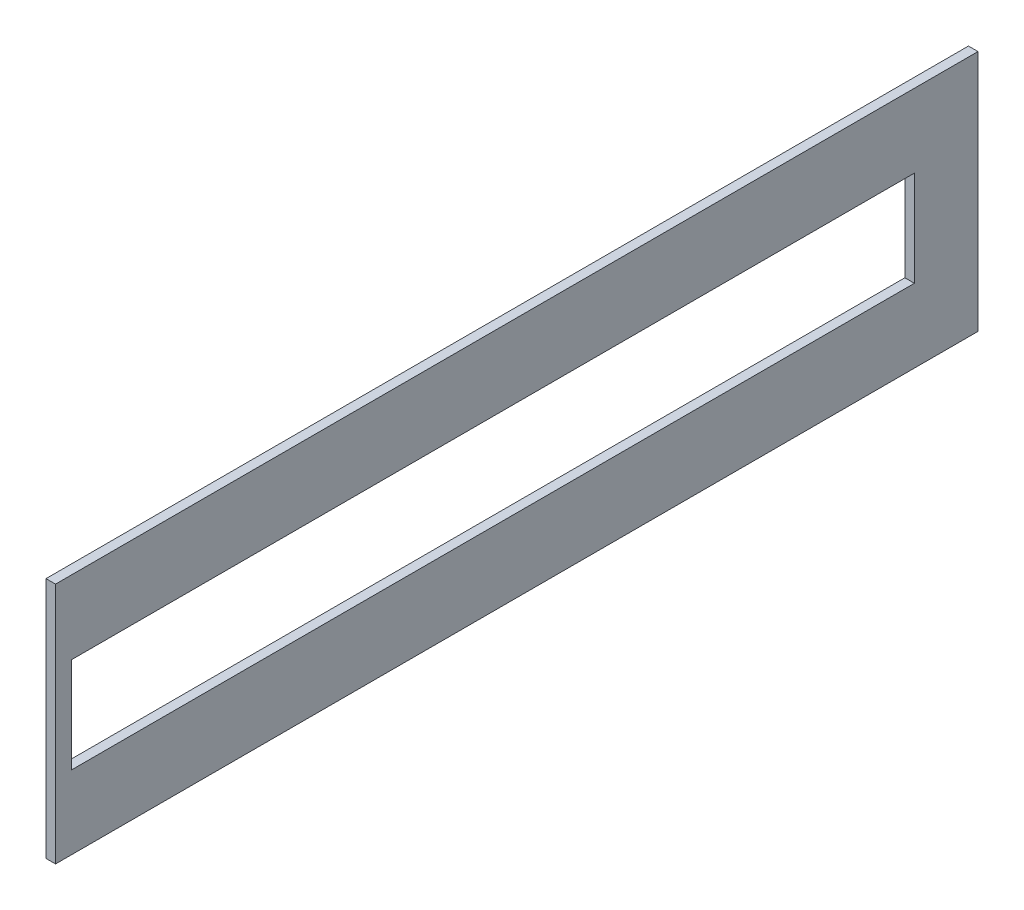
ISO-10303-21;
HEADER;
FILE_DESCRIPTION(('STEP AP214'),'2;1');
FILE_NAME('part.step','',(''),(''),'','','');
FILE_SCHEMA(('AUTOMOTIVE_DESIGN { 1 0 10303 214 1 1 1 1 }'));
ENDSEC;
DATA;
#1=APPLICATION_CONTEXT('core data for automotive mechanical design processes');
#2=APPLICATION_PROTOCOL_DEFINITION('international standard','automotive_design',2000,#1);
#3=PRODUCT_CONTEXT('',#1,'mechanical');
#4=PRODUCT('Part','Part','',(#3));
#5=PRODUCT_RELATED_PRODUCT_CATEGORY('part','',(#4));
#6=PRODUCT_DEFINITION_FORMATION('','',#4);
#7=PRODUCT_DEFINITION_CONTEXT('part definition',#1,'design');
#8=PRODUCT_DEFINITION('design','',#6,#7);
#9=PRODUCT_DEFINITION_SHAPE('','',#8);
#10=(LENGTH_UNIT() NAMED_UNIT(*) SI_UNIT(.MILLI.,.METRE.));
#11=(NAMED_UNIT(*) PLANE_ANGLE_UNIT() SI_UNIT($,.RADIAN.));
#12=(NAMED_UNIT(*) SI_UNIT($,.STERADIAN.) SOLID_ANGLE_UNIT());
#13=UNCERTAINTY_MEASURE_WITH_UNIT(LENGTH_MEASURE(1.E-05),#10,'distance_accuracy_value','');
#14=(GEOMETRIC_REPRESENTATION_CONTEXT(3) GLOBAL_UNCERTAINTY_ASSIGNED_CONTEXT((#13)) GLOBAL_UNIT_ASSIGNED_CONTEXT((#10,
#11,#12)) REPRESENTATION_CONTEXT('',''));
#15=CARTESIAN_POINT('',(0.,0.,0.));
#16=DIRECTION('',(0.,0.,1.));
#17=DIRECTION('',(1.,0.,0.));
#18=AXIS2_PLACEMENT_3D('',#15,#16,#17);
#19=CARTESIAN_POINT('',(3.,-38.1,-145.));
#20=DIRECTION('',(0.,0.,1.));
#21=DIRECTION('',(1.,0.,0.));
#22=AXIS2_PLACEMENT_3D('',#19,#20,#21);
#23=PLANE('',#22);
#24=DIRECTION('',(0.,1.,0.));
#25=VECTOR('',#24,1.);
#26=CARTESIAN_POINT('',(0.,-38.1,-145.));
#27=LINE('',#26,#25);
#28=CARTESIAN_POINT('',(0.,-38.1,-145.));
#29=VERTEX_POINT('',#28);
#30=CARTESIAN_POINT('',(0.,38.1,-145.));
#31=VERTEX_POINT('',#30);
#32=EDGE_CURVE('E133',#29,#31,#27,.T.);
#33=ORIENTED_EDGE('',*,*,#32,.T.);
#34=DIRECTION('',(-1.,0.,0.));
#35=VECTOR('',#34,1.);
#36=CARTESIAN_POINT('',(3.,38.1,-145.));
#37=LINE('',#36,#35);
#38=CARTESIAN_POINT('',(3.,38.1,-145.));
#39=VERTEX_POINT('',#38);
#40=EDGE_CURVE('E11',#39,#31,#37,.T.);
#41=ORIENTED_EDGE('',*,*,#40,.F.);
#42=DIRECTION('',(0.,1.,0.));
#43=VECTOR('',#42,1.);
#44=CARTESIAN_POINT('',(3.,-38.1,-145.));
#45=LINE('',#44,#43);
#46=CARTESIAN_POINT('',(3.,-38.1,-145.));
#47=VERTEX_POINT('',#46);
#48=EDGE_CURVE('E137',#47,#39,#45,.T.);
#49=ORIENTED_EDGE('',*,*,#48,.F.);
#50=DIRECTION('',(-1.,0.,0.));
#51=VECTOR('',#50,1.);
#52=CARTESIAN_POINT('',(3.,-38.1,-145.));
#53=LINE('',#52,#51);
#54=EDGE_CURVE('E147',#47,#29,#53,.T.);
#55=ORIENTED_EDGE('',*,*,#54,.T.);
#56=EDGE_LOOP('',(#33,#41,#49,#55));
#57=FACE_BOUND('',#56,.T.);
#58=ADVANCED_FACE('F36',(#57),#23,.F.);
#59=CARTESIAN_POINT('',(3.,38.1,145.));
#60=DIRECTION('',(0.,-1.,0.));
#61=DIRECTION('',(0.,0.,-1.));
#62=AXIS2_PLACEMENT_3D('',#59,#60,#61);
#63=PLANE('',#62);
#64=DIRECTION('',(0.,0.,1.));
#65=VECTOR('',#64,1.);
#66=CARTESIAN_POINT('',(0.,38.1,145.));
#67=LINE('',#66,#65);
#68=CARTESIAN_POINT('',(0.,38.1,145.));
#69=VERTEX_POINT('',#68);
#70=EDGE_CURVE('E150',#31,#69,#67,.T.);
#71=ORIENTED_EDGE('',*,*,#70,.T.);
#72=DIRECTION('',(-1.,0.,0.));
#73=VECTOR('',#72,1.);
#74=CARTESIAN_POINT('',(3.,38.1,145.));
#75=LINE('',#74,#73);
#76=CARTESIAN_POINT('',(3.,38.1,145.));
#77=VERTEX_POINT('',#76);
#78=EDGE_CURVE('E43',#77,#69,#75,.T.);
#79=ORIENTED_EDGE('',*,*,#78,.F.);
#80=DIRECTION('',(0.,0.,1.));
#81=VECTOR('',#80,1.);
#82=CARTESIAN_POINT('',(3.,38.1,145.));
#83=LINE('',#82,#81);
#84=EDGE_CURVE('E140',#39,#77,#83,.T.);
#85=ORIENTED_EDGE('',*,*,#84,.F.);
#86=ORIENTED_EDGE('',*,*,#40,.T.);
#87=EDGE_LOOP('',(#71,#79,#85,#86));
#88=FACE_BOUND('',#87,.T.);
#89=ADVANCED_FACE('F178',(#88),#63,.F.);
#90=CARTESIAN_POINT('',(3.,-38.1,145.));
#91=DIRECTION('',(0.,0.,-1.));
#92=DIRECTION('',(-1.,0.,0.));
#93=AXIS2_PLACEMENT_3D('',#90,#91,#92);
#94=PLANE('',#93);
#95=DIRECTION('',(0.,-1.,0.));
#96=VECTOR('',#95,1.);
#97=CARTESIAN_POINT('',(0.,-38.1,145.));
#98=LINE('',#97,#96);
#99=CARTESIAN_POINT('',(0.,-38.1,145.));
#100=VERTEX_POINT('',#99);
#101=EDGE_CURVE('E152',#69,#100,#98,.T.);
#102=ORIENTED_EDGE('',*,*,#101,.T.);
#103=DIRECTION('',(-1.,0.,0.));
#104=VECTOR('',#103,1.);
#105=CARTESIAN_POINT('',(3.,-38.1,145.));
#106=LINE('',#105,#104);
#107=CARTESIAN_POINT('',(3.,-38.1,145.));
#108=VERTEX_POINT('',#107);
#109=EDGE_CURVE('E157',#108,#100,#106,.T.);
#110=ORIENTED_EDGE('',*,*,#109,.F.);
#111=DIRECTION('',(0.,-1.,0.));
#112=VECTOR('',#111,1.);
#113=CARTESIAN_POINT('',(3.,-38.1,145.));
#114=LINE('',#113,#112);
#115=EDGE_CURVE('E143',#77,#108,#114,.T.);
#116=ORIENTED_EDGE('',*,*,#115,.F.);
#117=ORIENTED_EDGE('',*,*,#78,.T.);
#118=EDGE_LOOP('',(#102,#110,#116,#117));
#119=FACE_BOUND('',#118,.T.);
#120=ADVANCED_FACE('F164',(#119),#94,.F.);
#121=CARTESIAN_POINT('',(3.,-38.1,145.));
#122=DIRECTION('',(0.,1.,0.));
#123=DIRECTION('',(0.,0.,1.));
#124=AXIS2_PLACEMENT_3D('',#121,#122,#123);
#125=PLANE('',#124);
#126=DIRECTION('',(0.,0.,-1.));
#127=VECTOR('',#126,1.);
#128=CARTESIAN_POINT('',(0.,-38.1,145.));
#129=LINE('',#128,#127);
#130=EDGE_CURVE('E141',#100,#29,#129,.T.);
#131=ORIENTED_EDGE('',*,*,#130,.T.);
#132=ORIENTED_EDGE('',*,*,#54,.F.);
#133=DIRECTION('',(0.,0.,-1.));
#134=VECTOR('',#133,1.);
#135=CARTESIAN_POINT('',(3.,-38.1,145.));
#136=LINE('',#135,#134);
#137=EDGE_CURVE('E145',#108,#47,#136,.T.);
#138=ORIENTED_EDGE('',*,*,#137,.F.);
#139=ORIENTED_EDGE('',*,*,#109,.T.);
#140=EDGE_LOOP('',(#131,#132,#138,#139));
#141=FACE_BOUND('',#140,.T.);
#142=ADVANCED_FACE('F171',(#141),#125,.F.);
#143=CARTESIAN_POINT('',(3.,0.,0.));
#144=DIRECTION('',(-1.,0.,0.));
#145=DIRECTION('',(0.,0.,1.));
#146=AXIS2_PLACEMENT_3D('',#143,#144,#145);
#147=PLANE('',#146);
#148=DIRECTION('',(0.,0.,-1.));
#149=VECTOR('',#148,1.);
#150=CARTESIAN_POINT('',(3.,-15.,-125.));
#151=LINE('',#150,#149);
#152=CARTESIAN_POINT('',(3.,-15.,140.));
#153=VERTEX_POINT('',#152);
#154=CARTESIAN_POINT('',(3.,-15.,-125.));
#155=VERTEX_POINT('',#154);
#156=EDGE_CURVE('E127',#153,#155,#151,.T.);
#157=ORIENTED_EDGE('',*,*,#156,.F.);
#158=DIRECTION('',(0.,-1.,0.));
#159=VECTOR('',#158,1.);
#160=CARTESIAN_POINT('',(3.,-15.,140.));
#161=LINE('',#160,#159);
#162=CARTESIAN_POINT('',(3.,15.,140.));
#163=VERTEX_POINT('',#162);
#164=EDGE_CURVE('E50',#163,#153,#161,.T.);
#165=ORIENTED_EDGE('',*,*,#164,.F.);
#166=DIRECTION('',(0.,0.,1.));
#167=VECTOR('',#166,1.);
#168=CARTESIAN_POINT('',(3.,15.,140.));
#169=LINE('',#168,#167);
#170=CARTESIAN_POINT('',(3.,15.,-125.));
#171=VERTEX_POINT('',#170);
#172=EDGE_CURVE('E118',#171,#163,#169,.T.);
#173=ORIENTED_EDGE('',*,*,#172,.F.);
#174=DIRECTION('',(0.,1.,0.));
#175=VECTOR('',#174,1.);
#176=CARTESIAN_POINT('',(3.,15.,-125.));
#177=LINE('',#176,#175);
#178=EDGE_CURVE('E121',#155,#171,#177,.T.);
#179=ORIENTED_EDGE('',*,*,#178,.F.);
#180=EDGE_LOOP('',(#157,#165,#173,#179));
#181=FACE_BOUND('',#180,.T.);
#182=ORIENTED_EDGE('',*,*,#48,.T.);
#183=ORIENTED_EDGE('',*,*,#84,.T.);
#184=ORIENTED_EDGE('',*,*,#115,.T.);
#185=ORIENTED_EDGE('',*,*,#137,.T.);
#186=EDGE_LOOP('',(#182,#183,#184,#185));
#187=FACE_BOUND('',#186,.T.);
#188=ADVANCED_FACE('F177',(#181,#187),#147,.F.);
#189=CARTESIAN_POINT('',(0.,0.,0.));
#190=DIRECTION('',(-1.,0.,0.));
#191=DIRECTION('',(0.,0.,1.));
#192=AXIS2_PLACEMENT_3D('',#189,#190,#191);
#193=PLANE('',#192);
#194=DIRECTION('',(0.,-1.,0.));
#195=VECTOR('',#194,1.);
#196=CARTESIAN_POINT('',(0.,-15.,140.));
#197=LINE('',#196,#195);
#198=CARTESIAN_POINT('',(0.,15.,140.));
#199=VERTEX_POINT('',#198);
#200=CARTESIAN_POINT('',(0.,-15.,140.));
#201=VERTEX_POINT('',#200);
#202=EDGE_CURVE('E102',#199,#201,#197,.T.);
#203=ORIENTED_EDGE('',*,*,#202,.T.);
#204=DIRECTION('',(0.,0.,-1.));
#205=VECTOR('',#204,1.);
#206=CARTESIAN_POINT('',(0.,-15.,-125.));
#207=LINE('',#206,#205);
#208=CARTESIAN_POINT('',(0.,-15.,-125.));
#209=VERTEX_POINT('',#208);
#210=EDGE_CURVE('E111',#201,#209,#207,.T.);
#211=ORIENTED_EDGE('',*,*,#210,.T.);
#212=DIRECTION('',(0.,1.,0.));
#213=VECTOR('',#212,1.);
#214=CARTESIAN_POINT('',(0.,15.,-125.));
#215=LINE('',#214,#213);
#216=CARTESIAN_POINT('',(0.,15.,-125.));
#217=VERTEX_POINT('',#216);
#218=EDGE_CURVE('E58',#209,#217,#215,.T.);
#219=ORIENTED_EDGE('',*,*,#218,.T.);
#220=DIRECTION('',(0.,0.,1.));
#221=VECTOR('',#220,1.);
#222=CARTESIAN_POINT('',(0.,15.,140.));
#223=LINE('',#222,#221);
#224=EDGE_CURVE('E108',#217,#199,#223,.T.);
#225=ORIENTED_EDGE('',*,*,#224,.T.);
#226=EDGE_LOOP('',(#203,#211,#219,#225));
#227=FACE_BOUND('',#226,.T.);
#228=ORIENTED_EDGE('',*,*,#32,.F.);
#229=ORIENTED_EDGE('',*,*,#130,.F.);
#230=ORIENTED_EDGE('',*,*,#101,.F.);
#231=ORIENTED_EDGE('',*,*,#70,.F.);
#232=EDGE_LOOP('',(#228,#229,#230,#231));
#233=FACE_BOUND('',#232,.T.);
#234=ADVANCED_FACE('F115',(#227,#233),#193,.T.);
#235=CARTESIAN_POINT('',(0.,-15.,140.));
#236=DIRECTION('',(0.,0.,1.));
#237=DIRECTION('',(1.,0.,0.));
#238=AXIS2_PLACEMENT_3D('',#235,#236,#237);
#239=PLANE('',#238);
#240=ORIENTED_EDGE('',*,*,#164,.T.);
#241=DIRECTION('',(1.,0.,0.));
#242=VECTOR('',#241,1.);
#243=CARTESIAN_POINT('',(0.,-15.,140.));
#244=LINE('',#243,#242);
#245=EDGE_CURVE('E98',#201,#153,#244,.T.);
#246=ORIENTED_EDGE('',*,*,#245,.F.);
#247=ORIENTED_EDGE('',*,*,#202,.F.);
#248=DIRECTION('',(1.,0.,0.));
#249=VECTOR('',#248,1.);
#250=CARTESIAN_POINT('',(0.,15.,140.));
#251=LINE('',#250,#249);
#252=EDGE_CURVE('E131',#199,#163,#251,.T.);
#253=ORIENTED_EDGE('',*,*,#252,.T.);
#254=EDGE_LOOP('',(#240,#246,#247,#253));
#255=FACE_BOUND('',#254,.T.);
#256=ADVANCED_FACE('F100',(#255),#239,.F.);
#257=CARTESIAN_POINT('',(0.,15.,140.));
#258=DIRECTION('',(0.,1.,0.));
#259=DIRECTION('',(0.,0.,1.));
#260=AXIS2_PLACEMENT_3D('',#257,#258,#259);
#261=PLANE('',#260);
#262=ORIENTED_EDGE('',*,*,#172,.T.);
#263=ORIENTED_EDGE('',*,*,#252,.F.);
#264=ORIENTED_EDGE('',*,*,#224,.F.);
#265=DIRECTION('',(1.,0.,0.));
#266=VECTOR('',#265,1.);
#267=CARTESIAN_POINT('',(0.,15.,-125.));
#268=LINE('',#267,#266);
#269=EDGE_CURVE('E134',#217,#171,#268,.T.);
#270=ORIENTED_EDGE('',*,*,#269,.T.);
#271=EDGE_LOOP('',(#262,#263,#264,#270));
#272=FACE_BOUND('',#271,.T.);
#273=ADVANCED_FACE('F195',(#272),#261,.F.);
#274=CARTESIAN_POINT('',(0.,15.,-125.));
#275=DIRECTION('',(0.,0.,-1.));
#276=DIRECTION('',(-1.,0.,0.));
#277=AXIS2_PLACEMENT_3D('',#274,#275,#276);
#278=PLANE('',#277);
#279=ORIENTED_EDGE('',*,*,#178,.T.);
#280=ORIENTED_EDGE('',*,*,#269,.F.);
#281=ORIENTED_EDGE('',*,*,#218,.F.);
#282=DIRECTION('',(1.,0.,0.));
#283=VECTOR('',#282,1.);
#284=CARTESIAN_POINT('',(0.,-15.,-125.));
#285=LINE('',#284,#283);
#286=EDGE_CURVE('E107',#209,#155,#285,.T.);
#287=ORIENTED_EDGE('',*,*,#286,.T.);
#288=EDGE_LOOP('',(#279,#280,#281,#287));
#289=FACE_BOUND('',#288,.T.);
#290=ADVANCED_FACE('F198',(#289),#278,.F.);
#291=CARTESIAN_POINT('',(0.,-15.,-125.));
#292=DIRECTION('',(0.,-1.,0.));
#293=DIRECTION('',(0.,0.,-1.));
#294=AXIS2_PLACEMENT_3D('',#291,#292,#293);
#295=PLANE('',#294);
#296=ORIENTED_EDGE('',*,*,#156,.T.);
#297=ORIENTED_EDGE('',*,*,#286,.F.);
#298=ORIENTED_EDGE('',*,*,#210,.F.);
#299=ORIENTED_EDGE('',*,*,#245,.T.);
#300=EDGE_LOOP('',(#296,#297,#298,#299));
#301=FACE_BOUND('',#300,.T.);
#302=ADVANCED_FACE('F112',(#301),#295,.F.);
#303=CLOSED_SHELL('',(#58,#89,#120,#142,#188,#234,#256,#273,#290,#302));
#304=MANIFOLD_SOLID_BREP('B2',#303);
#305=ADVANCED_BREP_SHAPE_REPRESENTATION('',(#18,#304),#14);
#306=SHAPE_DEFINITION_REPRESENTATION(#9,#305);
ENDSEC;
END-ISO-10303-21;
